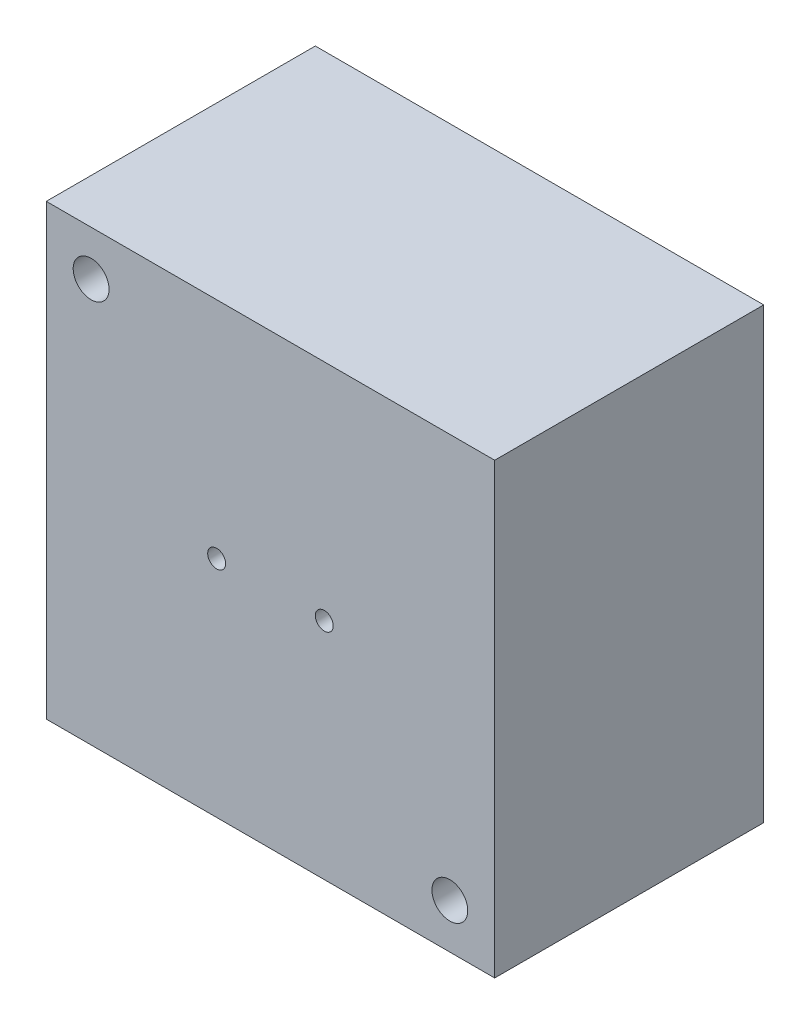
ISO-10303-21;
HEADER;
FILE_DESCRIPTION(('STEP AP214'),'2;1');
FILE_NAME('part.step','',(''),(''),'','','');
FILE_SCHEMA(('AUTOMOTIVE_DESIGN { 1 0 10303 214 1 1 1 1 }'));
ENDSEC;
DATA;
#1=APPLICATION_CONTEXT('core data for automotive mechanical design processes');
#2=APPLICATION_PROTOCOL_DEFINITION('international standard','automotive_design',2000,#1);
#3=PRODUCT_CONTEXT('',#1,'mechanical');
#4=PRODUCT('Part','Part','',(#3));
#5=PRODUCT_RELATED_PRODUCT_CATEGORY('part','',(#4));
#6=PRODUCT_DEFINITION_FORMATION('','',#4);
#7=PRODUCT_DEFINITION_CONTEXT('part definition',#1,'design');
#8=PRODUCT_DEFINITION('design','',#6,#7);
#9=PRODUCT_DEFINITION_SHAPE('','',#8);
#10=(LENGTH_UNIT() NAMED_UNIT(*) SI_UNIT(.MILLI.,.METRE.));
#11=(NAMED_UNIT(*) PLANE_ANGLE_UNIT() SI_UNIT($,.RADIAN.));
#12=(NAMED_UNIT(*) SI_UNIT($,.STERADIAN.) SOLID_ANGLE_UNIT());
#13=UNCERTAINTY_MEASURE_WITH_UNIT(LENGTH_MEASURE(1.E-05),#10,'distance_accuracy_value','');
#14=(GEOMETRIC_REPRESENTATION_CONTEXT(3) GLOBAL_UNCERTAINTY_ASSIGNED_CONTEXT((#13)) GLOBAL_UNIT_ASSIGNED_CONTEXT((#10,
#11,#12)) REPRESENTATION_CONTEXT('',''));
#15=CARTESIAN_POINT('',(0.,0.,0.));
#16=DIRECTION('',(0.,0.,1.));
#17=DIRECTION('',(1.,0.,0.));
#18=AXIS2_PLACEMENT_3D('',#15,#16,#17);
#19=CARTESIAN_POINT('',(0.,50.,30.));
#20=DIRECTION('',(0.,0.,-1.));
#21=DIRECTION('',(-1.,0.,0.));
#22=AXIS2_PLACEMENT_3D('',#19,#20,#21);
#23=PLANE('',#22);
#24=CARTESIAN_POINT('',(31.,25.,30.));
#25=DIRECTION('',(0.,0.,-1.));
#26=DIRECTION('',(-1.,0.,0.));
#27=AXIS2_PLACEMENT_3D('',#24,#25,#26);
#28=CIRCLE('',#27,1.);
#29=CARTESIAN_POINT('',(30.,25.,30.));
#30=VERTEX_POINT('',#29);
#31=EDGE_CURVE('E40',#30,#30,#28,.T.);
#32=ORIENTED_EDGE('',*,*,#31,.T.);
#33=EDGE_LOOP('',(#32));
#34=FACE_BOUND('',#33,.T.);
#35=CARTESIAN_POINT('',(19.,25.,30.));
#36=DIRECTION('',(0.,0.,-1.));
#37=DIRECTION('',(-1.,0.,0.));
#38=AXIS2_PLACEMENT_3D('',#35,#36,#37);
#39=CIRCLE('',#38,1.);
#40=CARTESIAN_POINT('',(18.,25.,30.));
#41=VERTEX_POINT('',#40);
#42=EDGE_CURVE('E118',#41,#41,#39,.T.);
#43=ORIENTED_EDGE('',*,*,#42,.T.);
#44=EDGE_LOOP('',(#43));
#45=FACE_BOUND('',#44,.T.);
#46=CARTESIAN_POINT('',(45.,5.00000000000002,30.));
#47=DIRECTION('',(0.,0.,-1.));
#48=DIRECTION('',(-1.,0.,0.));
#49=AXIS2_PLACEMENT_3D('',#46,#47,#48);
#50=CIRCLE('',#49,2.);
#51=CARTESIAN_POINT('',(43.,5.00000000000002,30.));
#52=VERTEX_POINT('',#51);
#53=EDGE_CURVE('E106',#52,#52,#50,.F.);
#54=ORIENTED_EDGE('',*,*,#53,.F.);
#55=EDGE_LOOP('',(#54));
#56=FACE_BOUND('',#55,.T.);
#57=DIRECTION('',(0.,-1.,0.));
#58=VECTOR('',#57,1.);
#59=CARTESIAN_POINT('',(0.,0.,30.));
#60=LINE('',#59,#58);
#61=CARTESIAN_POINT('',(0.,50.,30.));
#62=VERTEX_POINT('',#61);
#63=CARTESIAN_POINT('',(0.,0.,30.));
#64=VERTEX_POINT('',#63);
#65=EDGE_CURVE('E90',#62,#64,#60,.T.);
#66=ORIENTED_EDGE('',*,*,#65,.T.);
#67=DIRECTION('',(1.,0.,0.));
#68=VECTOR('',#67,1.);
#69=CARTESIAN_POINT('',(0.,0.,30.));
#70=LINE('',#69,#68);
#71=CARTESIAN_POINT('',(50.,0.,30.));
#72=VERTEX_POINT('',#71);
#73=EDGE_CURVE('E85',#64,#72,#70,.T.);
#74=ORIENTED_EDGE('',*,*,#73,.T.);
#75=DIRECTION('',(0.,1.,0.));
#76=VECTOR('',#75,1.);
#77=CARTESIAN_POINT('',(50.,0.,30.));
#78=LINE('',#77,#76);
#79=CARTESIAN_POINT('',(50.,50.,30.));
#80=VERTEX_POINT('',#79);
#81=EDGE_CURVE('E88',#72,#80,#78,.T.);
#82=ORIENTED_EDGE('',*,*,#81,.T.);
#83=DIRECTION('',(-1.,0.,0.));
#84=VECTOR('',#83,1.);
#85=CARTESIAN_POINT('',(0.,50.,30.));
#86=LINE('',#85,#84);
#87=EDGE_CURVE('E55',#80,#62,#86,.T.);
#88=ORIENTED_EDGE('',*,*,#87,.T.);
#89=EDGE_LOOP('',(#66,#74,#82,#88));
#90=FACE_BOUND('',#89,.T.);
#91=CARTESIAN_POINT('',(5.00000000000001,45.,30.));
#92=DIRECTION('',(0.,0.,-1.));
#93=DIRECTION('',(-1.,0.,0.));
#94=AXIS2_PLACEMENT_3D('',#91,#92,#93);
#95=CIRCLE('',#94,2.);
#96=CARTESIAN_POINT('',(5.24103277323876,46.9854226759622,30.));
#97=VERTEX_POINT('',#96);
#98=EDGE_CURVE('E115',#97,#97,#95,.F.);
#99=ORIENTED_EDGE('',*,*,#98,.F.);
#100=EDGE_LOOP('',(#99));
#101=FACE_BOUND('',#100,.T.);
#102=ADVANCED_FACE('F36',(#34,#45,#56,#90,#101),#23,.F.);
#103=CARTESIAN_POINT('',(0.,50.,0.));
#104=DIRECTION('',(0.,0.,-1.));
#105=DIRECTION('',(-1.,0.,0.));
#106=AXIS2_PLACEMENT_3D('',#103,#104,#105);
#107=PLANE('',#106);
#108=CARTESIAN_POINT('',(45.,5.00000000000002,0.));
#109=DIRECTION('',(0.,0.,-1.));
#110=DIRECTION('',(-1.,0.,0.));
#111=AXIS2_PLACEMENT_3D('',#108,#109,#110);
#112=CIRCLE('',#111,2.);
#113=CARTESIAN_POINT('',(43.,5.00000000000002,0.));
#114=VERTEX_POINT('',#113);
#115=EDGE_CURVE('E112',#114,#114,#112,.F.);
#116=ORIENTED_EDGE('',*,*,#115,.T.);
#117=EDGE_LOOP('',(#116));
#118=FACE_BOUND('',#117,.T.);
#119=DIRECTION('',(0.,-1.,0.));
#120=VECTOR('',#119,1.);
#121=CARTESIAN_POINT('',(0.,0.,0.));
#122=LINE('',#121,#120);
#123=CARTESIAN_POINT('',(0.,50.,0.));
#124=VERTEX_POINT('',#123);
#125=CARTESIAN_POINT('',(0.,0.,0.));
#126=VERTEX_POINT('',#125);
#127=EDGE_CURVE('E103',#124,#126,#122,.T.);
#128=ORIENTED_EDGE('',*,*,#127,.F.);
#129=DIRECTION('',(-1.,0.,0.));
#130=VECTOR('',#129,1.);
#131=CARTESIAN_POINT('',(0.,50.,0.));
#132=LINE('',#131,#130);
#133=CARTESIAN_POINT('',(50.,50.,0.));
#134=VERTEX_POINT('',#133);
#135=EDGE_CURVE('E78',#134,#124,#132,.T.);
#136=ORIENTED_EDGE('',*,*,#135,.F.);
#137=DIRECTION('',(0.,1.,0.));
#138=VECTOR('',#137,1.);
#139=CARTESIAN_POINT('',(50.,0.,0.));
#140=LINE('',#139,#138);
#141=CARTESIAN_POINT('',(50.,0.,0.));
#142=VERTEX_POINT('',#141);
#143=EDGE_CURVE('E72',#142,#134,#140,.T.);
#144=ORIENTED_EDGE('',*,*,#143,.F.);
#145=DIRECTION('',(1.,0.,0.));
#146=VECTOR('',#145,1.);
#147=CARTESIAN_POINT('',(0.,0.,0.));
#148=LINE('',#147,#146);
#149=EDGE_CURVE('E94',#126,#142,#148,.T.);
#150=ORIENTED_EDGE('',*,*,#149,.F.);
#151=EDGE_LOOP('',(#128,#136,#144,#150));
#152=FACE_BOUND('',#151,.T.);
#153=CARTESIAN_POINT('',(5.00000000000001,45.,0.));
#154=DIRECTION('',(0.,0.,-1.));
#155=DIRECTION('',(-1.,0.,0.));
#156=AXIS2_PLACEMENT_3D('',#153,#154,#155);
#157=CIRCLE('',#156,2.);
#158=CARTESIAN_POINT('',(5.24103277323876,46.9854226759622,0.));
#159=VERTEX_POINT('',#158);
#160=EDGE_CURVE('E116',#159,#159,#157,.F.);
#161=ORIENTED_EDGE('',*,*,#160,.T.);
#162=EDGE_LOOP('',(#161));
#163=FACE_BOUND('',#162,.T.);
#164=ADVANCED_FACE('F139',(#118,#152,#163),#107,.T.);
#165=CARTESIAN_POINT('',(0.,0.,30.));
#166=DIRECTION('',(1.,0.,0.));
#167=DIRECTION('',(0.,0.,-1.));
#168=AXIS2_PLACEMENT_3D('',#165,#166,#167);
#169=PLANE('',#168);
#170=ORIENTED_EDGE('',*,*,#127,.T.);
#171=DIRECTION('',(0.,0.,-1.));
#172=VECTOR('',#171,1.);
#173=CARTESIAN_POINT('',(0.,0.,30.));
#174=LINE('',#173,#172);
#175=EDGE_CURVE('E11',#64,#126,#174,.T.);
#176=ORIENTED_EDGE('',*,*,#175,.F.);
#177=ORIENTED_EDGE('',*,*,#65,.F.);
#178=DIRECTION('',(0.,0.,-1.));
#179=VECTOR('',#178,1.);
#180=CARTESIAN_POINT('',(0.,50.,30.));
#181=LINE('',#180,#179);
#182=EDGE_CURVE('E99',#62,#124,#181,.T.);
#183=ORIENTED_EDGE('',*,*,#182,.T.);
#184=EDGE_LOOP('',(#170,#176,#177,#183));
#185=FACE_BOUND('',#184,.T.);
#186=ADVANCED_FACE('F38',(#185),#169,.F.);
#187=CARTESIAN_POINT('',(0.,0.,30.));
#188=DIRECTION('',(0.,1.,0.));
#189=DIRECTION('',(0.,0.,1.));
#190=AXIS2_PLACEMENT_3D('',#187,#188,#189);
#191=PLANE('',#190);
#192=ORIENTED_EDGE('',*,*,#149,.T.);
#193=DIRECTION('',(0.,0.,-1.));
#194=VECTOR('',#193,1.);
#195=CARTESIAN_POINT('',(50.,0.,30.));
#196=LINE('',#195,#194);
#197=EDGE_CURVE('E46',#72,#142,#196,.T.);
#198=ORIENTED_EDGE('',*,*,#197,.F.);
#199=ORIENTED_EDGE('',*,*,#73,.F.);
#200=ORIENTED_EDGE('',*,*,#175,.T.);
#201=EDGE_LOOP('',(#192,#198,#199,#200));
#202=FACE_BOUND('',#201,.T.);
#203=ADVANCED_FACE('F93',(#202),#191,.F.);
#204=CARTESIAN_POINT('',(50.,0.,30.));
#205=DIRECTION('',(-1.,0.,0.));
#206=DIRECTION('',(0.,0.,1.));
#207=AXIS2_PLACEMENT_3D('',#204,#205,#206);
#208=PLANE('',#207);
#209=ORIENTED_EDGE('',*,*,#143,.T.);
#210=DIRECTION('',(0.,0.,-1.));
#211=VECTOR('',#210,1.);
#212=CARTESIAN_POINT('',(50.,50.,30.));
#213=LINE('',#212,#211);
#214=EDGE_CURVE('E95',#80,#134,#213,.T.);
#215=ORIENTED_EDGE('',*,*,#214,.F.);
#216=ORIENTED_EDGE('',*,*,#81,.F.);
#217=ORIENTED_EDGE('',*,*,#197,.T.);
#218=EDGE_LOOP('',(#209,#215,#216,#217));
#219=FACE_BOUND('',#218,.T.);
#220=ADVANCED_FACE('F97',(#219),#208,.F.);
#221=CARTESIAN_POINT('',(0.,50.,30.));
#222=DIRECTION('',(0.,-1.,0.));
#223=DIRECTION('',(0.,0.,-1.));
#224=AXIS2_PLACEMENT_3D('',#221,#222,#223);
#225=PLANE('',#224);
#226=ORIENTED_EDGE('',*,*,#135,.T.);
#227=ORIENTED_EDGE('',*,*,#182,.F.);
#228=ORIENTED_EDGE('',*,*,#87,.F.);
#229=ORIENTED_EDGE('',*,*,#214,.T.);
#230=EDGE_LOOP('',(#226,#227,#228,#229));
#231=FACE_BOUND('',#230,.T.);
#232=ADVANCED_FACE('F152',(#231),#225,.F.);
#233=CARTESIAN_POINT('',(45.,5.00000000000002,47.4374877599855));
#234=DIRECTION('',(0.,0.,-1.));
#235=DIRECTION('',(-1.,0.,0.));
#236=AXIS2_PLACEMENT_3D('',#233,#234,#235);
#237=CYLINDRICAL_SURFACE('',#236,2.);
#238=ORIENTED_EDGE('',*,*,#115,.F.);
#239=EDGE_LOOP('',(#238));
#240=FACE_BOUND('',#239,.T.);
#241=ORIENTED_EDGE('',*,*,#53,.T.);
#242=EDGE_LOOP('',(#241));
#243=FACE_BOUND('',#242,.T.);
#244=ADVANCED_FACE('F136',(#240,#243),#237,.F.);
#245=CARTESIAN_POINT('',(5.00000000000001,45.,47.4374877599855));
#246=DIRECTION('',(0.,0.,-1.));
#247=DIRECTION('',(0.120516386619375,0.992711337981092,0.));
#248=AXIS2_PLACEMENT_3D('',#245,#246,#247);
#249=CYLINDRICAL_SURFACE('',#248,2.);
#250=CARTESIAN_POINT('',(5.24103277323876,46.9854226759622,0.));
#251=CARTESIAN_POINT('',(5.24103277323876,46.9854226759622,0.312500000000008));
#252=CARTESIAN_POINT('',(5.24103277323876,46.9854226759622,0.625000000000008));
#253=CARTESIAN_POINT('',(5.24103277323876,46.9854226759622,1.25000000000001));
#254=CARTESIAN_POINT('',(5.24103277323876,46.9854226759622,1.56250000000001));
#255=CARTESIAN_POINT('',(5.24103277323876,46.9854226759622,2.18750000000001));
#256=CARTESIAN_POINT('',(5.24103277323876,46.9854226759622,2.50000000000001));
#257=CARTESIAN_POINT('',(5.24103277323876,46.9854226759622,3.12500000000001));
#258=CARTESIAN_POINT('',(5.24103277323876,46.9854226759622,3.43750000000001));
#259=CARTESIAN_POINT('',(5.24103277323876,46.9854226759622,4.06250000000001));
#260=CARTESIAN_POINT('',(5.24103277323876,46.9854226759622,4.37500000000001));
#261=CARTESIAN_POINT('',(5.24103277323876,46.9854226759622,5.));
#262=CARTESIAN_POINT('',(5.24103277323876,46.9854226759622,5.3125));
#263=CARTESIAN_POINT('',(5.24103277323876,46.9854226759622,5.93750000000001));
#264=CARTESIAN_POINT('',(5.24103277323876,46.9854226759622,6.25000000000001));
#265=CARTESIAN_POINT('',(5.24103277323876,46.9854226759622,6.87500000000001));
#266=CARTESIAN_POINT('',(5.24103277323876,46.9854226759622,7.18750000000001));
#267=CARTESIAN_POINT('',(5.24103277323876,46.9854226759622,7.81250000000001));
#268=CARTESIAN_POINT('',(5.24103277323876,46.9854226759622,8.12500000000001));
#269=CARTESIAN_POINT('',(5.24103277323876,46.9854226759622,8.75000000000001));
#270=CARTESIAN_POINT('',(5.24103277323876,46.9854226759622,9.06250000000001));
#271=CARTESIAN_POINT('',(5.24103277323876,46.9854226759622,9.68750000000001));
#272=CARTESIAN_POINT('',(5.24103277323876,46.9854226759622,10.));
#273=CARTESIAN_POINT('',(5.24103277323876,46.9854226759622,10.625));
#274=CARTESIAN_POINT('',(5.24103277323876,46.9854226759622,10.9375));
#275=CARTESIAN_POINT('',(5.24103277323876,46.9854226759622,11.5625));
#276=CARTESIAN_POINT('',(5.24103277323876,46.9854226759622,11.875));
#277=CARTESIAN_POINT('',(5.24103277323876,46.9854226759622,12.5));
#278=CARTESIAN_POINT('',(5.24103277323876,46.9854226759622,12.8125));
#279=CARTESIAN_POINT('',(5.24103277323876,46.9854226759622,13.4375));
#280=CARTESIAN_POINT('',(5.24103277323876,46.9854226759622,13.75));
#281=CARTESIAN_POINT('',(5.24103277323876,46.9854226759622,14.375));
#282=CARTESIAN_POINT('',(5.24103277323876,46.9854226759622,14.6875));
#283=CARTESIAN_POINT('',(5.24103277323876,46.9854226759622,15.3125));
#284=CARTESIAN_POINT('',(5.24103277323876,46.9854226759622,15.625));
#285=CARTESIAN_POINT('',(5.24103277323876,46.9854226759622,16.25));
#286=CARTESIAN_POINT('',(5.24103277323876,46.9854226759622,16.5625));
#287=CARTESIAN_POINT('',(5.24103277323876,46.9854226759622,17.1875));
#288=CARTESIAN_POINT('',(5.24103277323876,46.9854226759622,17.5));
#289=CARTESIAN_POINT('',(5.24103277323876,46.9854226759622,18.125));
#290=CARTESIAN_POINT('',(5.24103277323876,46.9854226759622,18.4375));
#291=CARTESIAN_POINT('',(5.24103277323876,46.9854226759622,19.0625));
#292=CARTESIAN_POINT('',(5.24103277323876,46.9854226759622,19.375));
#293=CARTESIAN_POINT('',(5.24103277323876,46.9854226759622,20.));
#294=CARTESIAN_POINT('',(5.24103277323876,46.9854226759622,20.3125));
#295=CARTESIAN_POINT('',(5.24103277323876,46.9854226759622,20.9375));
#296=CARTESIAN_POINT('',(5.24103277323876,46.9854226759622,21.25));
#297=CARTESIAN_POINT('',(5.24103277323876,46.9854226759622,21.875));
#298=CARTESIAN_POINT('',(5.24103277323876,46.9854226759622,22.1875));
#299=CARTESIAN_POINT('',(5.24103277323876,46.9854226759622,22.8125));
#300=CARTESIAN_POINT('',(5.24103277323876,46.9854226759622,23.125));
#301=CARTESIAN_POINT('',(5.24103277323876,46.9854226759622,23.75));
#302=CARTESIAN_POINT('',(5.24103277323876,46.9854226759622,24.0625));
#303=CARTESIAN_POINT('',(5.24103277323876,46.9854226759622,24.6875));
#304=CARTESIAN_POINT('',(5.24103277323876,46.9854226759622,25.));
#305=CARTESIAN_POINT('',(5.24103277323876,46.9854226759622,25.625));
#306=CARTESIAN_POINT('',(5.24103277323876,46.9854226759622,25.9375));
#307=CARTESIAN_POINT('',(5.24103277323876,46.9854226759622,26.5625));
#308=CARTESIAN_POINT('',(5.24103277323876,46.9854226759622,26.875));
#309=CARTESIAN_POINT('',(5.24103277323876,46.9854226759622,27.5));
#310=CARTESIAN_POINT('',(5.24103277323876,46.9854226759622,27.8125));
#311=CARTESIAN_POINT('',(5.24103277323876,46.9854226759622,28.4375));
#312=CARTESIAN_POINT('',(5.24103277323876,46.9854226759622,28.75));
#313=CARTESIAN_POINT('',(5.24103277323876,46.9854226759622,29.375));
#314=CARTESIAN_POINT('',(5.24103277323876,46.9854226759622,29.6875));
#315=CARTESIAN_POINT('',(5.24103277323876,46.9854226759622,30.));
#316=B_SPLINE_CURVE_WITH_KNOTS('',3,(#250,#251,#252,#253,#254,#255,#256,#257,#258,#259,#260,
#261,#262,#263,#264,#265,#266,#267,#268,#269,#270,#271,#272,#273,#274,#275,#276,#277,#278,#279,
#280,#281,#282,#283,#284,#285,#286,#287,#288,#289,#290,#291,#292,#293,#294,#295,#296,#297,#298,
#299,#300,#301,#302,#303,#304,#305,#306,#307,#308,#309,#310,#311,#312,#313,#314,#315),
.UNSPECIFIED.,.F.,.F.,(4,2,2,2,2,2,2,2,2,2,2,2,2,2,2,2,2,2,2,2,2,2,2,2,2,2,2,2,2,2,2,2,4),(0.,
0.937500000000001,1.875,2.8125,3.75,4.6875,5.625,6.5625,7.5,8.4375,9.375,10.3125,11.25,12.1875,
13.125,14.0625,15.,15.9375,16.875,17.8125,18.75,19.6875,20.625,21.5625,22.5,23.4375,24.375,
25.3125,26.25,27.1875,28.125,29.0625,30.),.UNSPECIFIED.);
#317=EDGE_CURVE('BSEAM168',#159,#97,#316,.T.);
#318=ORIENTED_EDGE('',*,*,#160,.F.);
#319=ORIENTED_EDGE('',*,*,#98,.T.);
#320=ORIENTED_EDGE('',*,*,#317,.T.);
#321=ORIENTED_EDGE('',*,*,#317,.F.);
#322=EDGE_LOOP('',(#318,#320,#319,#321));
#323=FACE_BOUND('',#322,.T.);
#324=ADVANCED_FACE('F168',(#323),#249,.F.);
#325=CARTESIAN_POINT('',(19.,25.,62.4999999999999));
#326=DIRECTION('',(0.,0.,1.));
#327=DIRECTION('',(0.750589897223236,-0.660768345327175,0.));
#328=AXIS2_PLACEMENT_3D('',#325,#326,#327);
#329=CYLINDRICAL_SURFACE('',#328,1.);
#330=CARTESIAN_POINT('',(19.,25.,15.4999999999999));
#331=DIRECTION('',(0.,0.,1.));
#332=DIRECTION('',(0.750589897223236,-0.660768345327175,0.));
#333=AXIS2_PLACEMENT_3D('',#330,#331,#332);
#334=CIRCLE('',#333,1.);
#335=CARTESIAN_POINT('',(19.7505898972233,24.3392316546728,15.4999999999999));
#336=VERTEX_POINT('',#335);
#337=EDGE_CURVE('E120',#336,#336,#334,.T.);
#338=ORIENTED_EDGE('',*,*,#337,.F.);
#339=EDGE_LOOP('',(#338));
#340=FACE_BOUND('',#339,.T.);
#341=ORIENTED_EDGE('',*,*,#42,.F.);
#342=EDGE_LOOP('',(#341));
#343=FACE_BOUND('',#342,.T.);
#344=ADVANCED_FACE('F171',(#340,#343),#329,.F.);
#345=CARTESIAN_POINT('',(19.6607683453272,25.7505898972232,15.4999999999999));
#346=DIRECTION('',(0.,0.,-1.));
#347=DIRECTION('',(-0.750589897223236,0.660768345327175,0.));
#348=AXIS2_PLACEMENT_3D('',#345,#346,#347);
#349=PLANE('',#348);
#350=ORIENTED_EDGE('',*,*,#337,.T.);
#351=EDGE_LOOP('',(#350));
#352=FACE_BOUND('',#351,.T.);
#353=ADVANCED_FACE('F176',(#352),#349,.F.);
#354=CARTESIAN_POINT('',(31.,25.,62.4999999999999));
#355=DIRECTION('',(0.,0.,1.));
#356=DIRECTION('',(0.418932106556393,0.908017560455866,0.));
#357=AXIS2_PLACEMENT_3D('',#354,#355,#356);
#358=CYLINDRICAL_SURFACE('',#357,1.);
#359=CARTESIAN_POINT('',(31.,25.,15.4999999999999));
#360=DIRECTION('',(0.,0.,1.));
#361=DIRECTION('',(0.418932106556393,0.908017560455866,0.));
#362=AXIS2_PLACEMENT_3D('',#359,#360,#361);
#363=CIRCLE('',#362,1.);
#364=CARTESIAN_POINT('',(31.4189321065564,25.9080175604559,15.4999999999999));
#365=VERTEX_POINT('',#364);
#366=EDGE_CURVE('E128',#365,#365,#363,.T.);
#367=ORIENTED_EDGE('',*,*,#366,.F.);
#368=EDGE_LOOP('',(#367));
#369=FACE_BOUND('',#368,.T.);
#370=ORIENTED_EDGE('',*,*,#31,.F.);
#371=EDGE_LOOP('',(#370));
#372=FACE_BOUND('',#371,.T.);
#373=ADVANCED_FACE('F183',(#369,#372),#358,.F.);
#374=CARTESIAN_POINT('',(30.0919824395441,25.4189321065564,15.4999999999999));
#375=DIRECTION('',(0.,0.,-1.));
#376=DIRECTION('',(-0.418932106556393,-0.908017560455866,0.));
#377=AXIS2_PLACEMENT_3D('',#374,#375,#376);
#378=PLANE('',#377);
#379=ORIENTED_EDGE('',*,*,#366,.T.);
#380=EDGE_LOOP('',(#379));
#381=FACE_BOUND('',#380,.T.);
#382=ADVANCED_FACE('F186',(#381),#378,.F.);
#383=CLOSED_SHELL('',(#102,#164,#186,#203,#220,#232,#244,#324,#344,#353,#373,#382));
#384=MANIFOLD_SOLID_BREP('B2',#383);
#385=ADVANCED_BREP_SHAPE_REPRESENTATION('',(#18,#384),#14);
#386=SHAPE_DEFINITION_REPRESENTATION(#9,#385);
ENDSEC;
END-ISO-10303-21;
